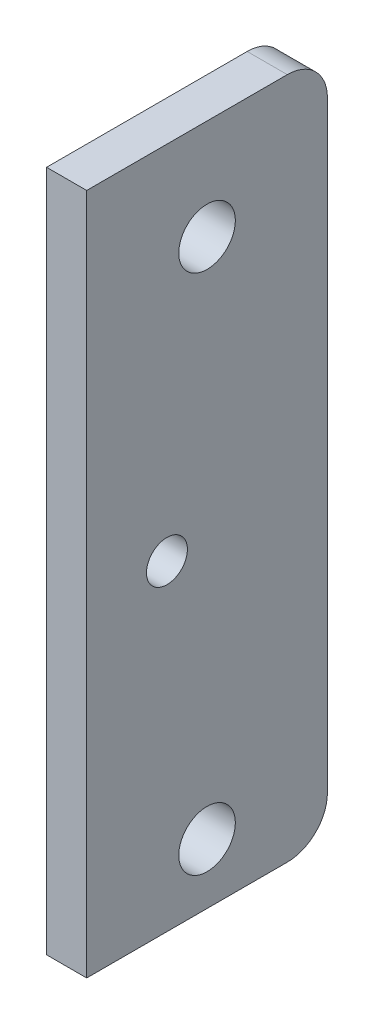
ISO-10303-21;
HEADER;
FILE_DESCRIPTION(('STEP AP214'),'2;1');
FILE_NAME('part.step','',(''),(''),'','','');
FILE_SCHEMA(('AUTOMOTIVE_DESIGN { 1 0 10303 214 1 1 1 1 }'));
ENDSEC;
DATA;
#1=APPLICATION_CONTEXT('core data for automotive mechanical design processes');
#2=APPLICATION_PROTOCOL_DEFINITION('international standard','automotive_design',2000,#1);
#3=PRODUCT_CONTEXT('',#1,'mechanical');
#4=PRODUCT('Part','Part','',(#3));
#5=PRODUCT_RELATED_PRODUCT_CATEGORY('part','',(#4));
#6=PRODUCT_DEFINITION_FORMATION('','',#4);
#7=PRODUCT_DEFINITION_CONTEXT('part definition',#1,'design');
#8=PRODUCT_DEFINITION('design','',#6,#7);
#9=PRODUCT_DEFINITION_SHAPE('','',#8);
#10=(LENGTH_UNIT() NAMED_UNIT(*) SI_UNIT(.MILLI.,.METRE.));
#11=(NAMED_UNIT(*) PLANE_ANGLE_UNIT() SI_UNIT($,.RADIAN.));
#12=(NAMED_UNIT(*) SI_UNIT($,.STERADIAN.) SOLID_ANGLE_UNIT());
#13=UNCERTAINTY_MEASURE_WITH_UNIT(LENGTH_MEASURE(1.E-05),#10,'distance_accuracy_value','');
#14=(GEOMETRIC_REPRESENTATION_CONTEXT(3) GLOBAL_UNCERTAINTY_ASSIGNED_CONTEXT((#13)) GLOBAL_UNIT_ASSIGNED_CONTEXT((#10,
#11,#12)) REPRESENTATION_CONTEXT('',''));
#15=CARTESIAN_POINT('',(0.,0.,0.));
#16=DIRECTION('',(0.,0.,1.));
#17=DIRECTION('',(1.,0.,0.));
#18=AXIS2_PLACEMENT_3D('',#15,#16,#17);
#19=CARTESIAN_POINT('',(-35.,0.,0.));
#20=DIRECTION('',(1.,0.,0.));
#21=DIRECTION('',(0.,0.,1.));
#22=AXIS2_PLACEMENT_3D('',#19,#20,#21);
#23=PLANE('',#22);
#24=CARTESIAN_POINT('',(-35.,-90.,-20.));
#25=DIRECTION('',(1.,0.,0.));
#26=DIRECTION('',(0.,0.,-1.));
#27=AXIS2_PLACEMENT_3D('',#24,#25,#26);
#28=CIRCLE('',#27,5.09999999999999);
#29=CARTESIAN_POINT('',(-35.,-90.,-25.1));
#30=VERTEX_POINT('',#29);
#31=EDGE_CURVE('E155',#30,#30,#28,.T.);
#32=ORIENTED_EDGE('',*,*,#31,.T.);
#33=EDGE_LOOP('',(#32));
#34=FACE_BOUND('',#33,.T.);
#35=DIRECTION('',(0.,0.,-1.));
#36=VECTOR('',#35,1.);
#37=CARTESIAN_POINT('',(-35.,-170.,0.));
#38=LINE('',#37,#36);
#39=CARTESIAN_POINT('',(-35.,-170.,0.));
#40=VERTEX_POINT('',#39);
#41=CARTESIAN_POINT('',(-35.,-170.,-50.));
#42=VERTEX_POINT('',#41);
#43=EDGE_CURVE('E109',#40,#42,#38,.T.);
#44=ORIENTED_EDGE('',*,*,#43,.F.);
#45=DIRECTION('',(0.,-1.,0.));
#46=VECTOR('',#45,1.);
#47=CARTESIAN_POINT('',(-35.,-170.,0.));
#48=LINE('',#47,#46);
#49=CARTESIAN_POINT('',(-35.,0.,0.));
#50=VERTEX_POINT('',#49);
#51=EDGE_CURVE('E92',#50,#40,#48,.T.);
#52=ORIENTED_EDGE('',*,*,#51,.F.);
#53=DIRECTION('',(0.,0.,1.));
#54=VECTOR('',#53,1.);
#55=CARTESIAN_POINT('',(-35.,0.,0.));
#56=LINE('',#55,#54);
#57=CARTESIAN_POINT('',(-35.,0.,-50.));
#58=VERTEX_POINT('',#57);
#59=EDGE_CURVE('E101',#58,#50,#56,.T.);
#60=ORIENTED_EDGE('',*,*,#59,.F.);
#61=CARTESIAN_POINT('',(-35.,-10.,-50.));
#62=DIRECTION('',(-1.,0.,0.));
#63=DIRECTION('',(0.,0.,1.));
#64=AXIS2_PLACEMENT_3D('',#61,#62,#63);
#65=CIRCLE('',#64,10.);
#66=CARTESIAN_POINT('',(-35.,-10.,-60.));
#67=VERTEX_POINT('',#66);
#68=EDGE_CURVE('E134',#67,#58,#65,.F.);
#69=ORIENTED_EDGE('',*,*,#68,.F.);
#70=DIRECTION('',(0.,1.,0.));
#71=VECTOR('',#70,1.);
#72=CARTESIAN_POINT('',(-35.,-170.,-60.));
#73=LINE('',#72,#71);
#74=CARTESIAN_POINT('',(-35.,-160.,-60.));
#75=VERTEX_POINT('',#74);
#76=EDGE_CURVE('E105',#75,#67,#73,.T.);
#77=ORIENTED_EDGE('',*,*,#76,.F.);
#78=CARTESIAN_POINT('',(-35.,-160.,-50.));
#79=DIRECTION('',(-1.,0.,0.));
#80=DIRECTION('',(0.,0.,1.));
#81=AXIS2_PLACEMENT_3D('',#78,#79,#80);
#82=CIRCLE('',#81,10.);
#83=EDGE_CURVE('E44',#42,#75,#82,.F.);
#84=ORIENTED_EDGE('',*,*,#83,.F.);
#85=EDGE_LOOP('',(#44,#52,#60,#69,#77,#84));
#86=FACE_BOUND('',#85,.T.);
#87=CARTESIAN_POINT('',(-35.,-25.,-30.));
#88=DIRECTION('',(1.,0.,0.));
#89=DIRECTION('',(0.,0.,-1.));
#90=AXIS2_PLACEMENT_3D('',#87,#88,#89);
#91=CIRCLE('',#90,7.05);
#92=CARTESIAN_POINT('',(-35.,-25.,-37.05));
#93=VERTEX_POINT('',#92);
#94=EDGE_CURVE('E118',#93,#93,#91,.T.);
#95=ORIENTED_EDGE('',*,*,#94,.T.);
#96=EDGE_LOOP('',(#95));
#97=FACE_BOUND('',#96,.T.);
#98=CARTESIAN_POINT('',(-35.,-155.,-30.));
#99=DIRECTION('',(1.,0.,0.));
#100=DIRECTION('',(0.,0.,-1.));
#101=AXIS2_PLACEMENT_3D('',#98,#99,#100);
#102=CIRCLE('',#101,7.05);
#103=CARTESIAN_POINT('',(-35.,-155.,-37.05));
#104=VERTEX_POINT('',#103);
#105=EDGE_CURVE('E144',#104,#104,#102,.T.);
#106=ORIENTED_EDGE('',*,*,#105,.T.);
#107=EDGE_LOOP('',(#106));
#108=FACE_BOUND('',#107,.T.);
#109=ADVANCED_FACE('F36',(#34,#86,#97,#108),#23,.F.);
#110=CARTESIAN_POINT('',(-25.,0.,0.));
#111=DIRECTION('',(1.,0.,0.));
#112=DIRECTION('',(0.,0.,1.));
#113=AXIS2_PLACEMENT_3D('',#110,#111,#112);
#114=PLANE('',#113);
#115=CARTESIAN_POINT('',(-25.,-90.,-20.));
#116=DIRECTION('',(-1.,0.,0.));
#117=DIRECTION('',(0.,0.,1.));
#118=AXIS2_PLACEMENT_3D('',#115,#116,#117);
#119=CIRCLE('',#118,5.09999999999999);
#120=CARTESIAN_POINT('',(-25.,-90.,-14.9));
#121=VERTEX_POINT('',#120);
#122=EDGE_CURVE('E150',#121,#121,#119,.T.);
#123=ORIENTED_EDGE('',*,*,#122,.T.);
#124=EDGE_LOOP('',(#123));
#125=FACE_BOUND('',#124,.T.);
#126=CARTESIAN_POINT('',(-25.,-25.,-30.));
#127=DIRECTION('',(1.,0.,0.));
#128=DIRECTION('',(0.,0.,-1.));
#129=AXIS2_PLACEMENT_3D('',#126,#127,#128);
#130=CIRCLE('',#129,7.05);
#131=CARTESIAN_POINT('',(-25.,-25.,-37.05));
#132=VERTEX_POINT('',#131);
#133=EDGE_CURVE('E141',#132,#132,#130,.T.);
#134=ORIENTED_EDGE('',*,*,#133,.F.);
#135=EDGE_LOOP('',(#134));
#136=FACE_BOUND('',#135,.T.);
#137=DIRECTION('',(0.,1.,0.));
#138=VECTOR('',#137,1.);
#139=CARTESIAN_POINT('',(-25.,-170.,-60.));
#140=LINE('',#139,#138);
#141=CARTESIAN_POINT('',(-25.,-160.,-60.));
#142=VERTEX_POINT('',#141);
#143=CARTESIAN_POINT('',(-25.,-10.,-60.));
#144=VERTEX_POINT('',#143);
#145=EDGE_CURVE('E114',#142,#144,#140,.T.);
#146=ORIENTED_EDGE('',*,*,#145,.T.);
#147=CARTESIAN_POINT('',(-25.,-10.,-50.));
#148=DIRECTION('',(-1.,0.,0.));
#149=DIRECTION('',(0.,0.,1.));
#150=AXIS2_PLACEMENT_3D('',#147,#148,#149);
#151=CIRCLE('',#150,10.);
#152=CARTESIAN_POINT('',(-25.,0.,-50.));
#153=VERTEX_POINT('',#152);
#154=EDGE_CURVE('E128',#153,#144,#151,.T.);
#155=ORIENTED_EDGE('',*,*,#154,.F.);
#156=DIRECTION('',(0.,0.,1.));
#157=VECTOR('',#156,1.);
#158=CARTESIAN_POINT('',(-25.,0.,0.));
#159=LINE('',#158,#157);
#160=CARTESIAN_POINT('',(-25.,0.,0.));
#161=VERTEX_POINT('',#160);
#162=EDGE_CURVE('E117',#153,#161,#159,.T.);
#163=ORIENTED_EDGE('',*,*,#162,.T.);
#164=DIRECTION('',(0.,-1.,0.));
#165=VECTOR('',#164,1.);
#166=CARTESIAN_POINT('',(-25.,-170.,0.));
#167=LINE('',#166,#165);
#168=CARTESIAN_POINT('',(-25.,-170.,0.));
#169=VERTEX_POINT('',#168);
#170=EDGE_CURVE('E95',#161,#169,#167,.T.);
#171=ORIENTED_EDGE('',*,*,#170,.T.);
#172=DIRECTION('',(0.,0.,-1.));
#173=VECTOR('',#172,1.);
#174=CARTESIAN_POINT('',(-25.,-170.,0.));
#175=LINE('',#174,#173);
#176=CARTESIAN_POINT('',(-25.,-170.,-50.));
#177=VERTEX_POINT('',#176);
#178=EDGE_CURVE('E121',#169,#177,#175,.T.);
#179=ORIENTED_EDGE('',*,*,#178,.T.);
#180=CARTESIAN_POINT('',(-25.,-160.,-50.));
#181=DIRECTION('',(-1.,0.,0.));
#182=DIRECTION('',(0.,0.,1.));
#183=AXIS2_PLACEMENT_3D('',#180,#181,#182);
#184=CIRCLE('',#183,10.);
#185=EDGE_CURVE('E131',#142,#177,#184,.T.);
#186=ORIENTED_EDGE('',*,*,#185,.F.);
#187=EDGE_LOOP('',(#146,#155,#163,#171,#179,#186));
#188=FACE_BOUND('',#187,.T.);
#189=CARTESIAN_POINT('',(-25.,-155.,-30.));
#190=DIRECTION('',(1.,0.,0.));
#191=DIRECTION('',(0.,0.,-1.));
#192=AXIS2_PLACEMENT_3D('',#189,#190,#191);
#193=CIRCLE('',#192,7.05);
#194=CARTESIAN_POINT('',(-25.,-155.,-37.05));
#195=VERTEX_POINT('',#194);
#196=EDGE_CURVE('E147',#195,#195,#193,.T.);
#197=ORIENTED_EDGE('',*,*,#196,.F.);
#198=EDGE_LOOP('',(#197));
#199=FACE_BOUND('',#198,.T.);
#200=ADVANCED_FACE('F166',(#125,#136,#188,#199),#114,.T.);
#201=CARTESIAN_POINT('',(-35.,-170.,-60.));
#202=DIRECTION('',(0.,0.,1.));
#203=DIRECTION('',(-1.,0.,0.));
#204=AXIS2_PLACEMENT_3D('',#201,#202,#203);
#205=PLANE('',#204);
#206=ORIENTED_EDGE('',*,*,#76,.T.);
#207=DIRECTION('',(1.,0.,0.));
#208=VECTOR('',#207,1.);
#209=CARTESIAN_POINT('',(-35.,-10.,-60.));
#210=LINE('',#209,#208);
#211=EDGE_CURVE('E97',#144,#67,#210,.F.);
#212=ORIENTED_EDGE('',*,*,#211,.F.);
#213=ORIENTED_EDGE('',*,*,#145,.F.);
#214=DIRECTION('',(1.,0.,0.));
#215=VECTOR('',#214,1.);
#216=CARTESIAN_POINT('',(-35.,-160.,-60.));
#217=LINE('',#216,#215);
#218=EDGE_CURVE('E126',#75,#142,#217,.T.);
#219=ORIENTED_EDGE('',*,*,#218,.F.);
#220=EDGE_LOOP('',(#206,#212,#213,#219));
#221=FACE_BOUND('',#220,.T.);
#222=ADVANCED_FACE('F169',(#221),#205,.F.);
#223=CARTESIAN_POINT('',(-35.,0.,0.));
#224=DIRECTION('',(0.,-1.,0.));
#225=DIRECTION('',(0.,0.,-1.));
#226=AXIS2_PLACEMENT_3D('',#223,#224,#225);
#227=PLANE('',#226);
#228=ORIENTED_EDGE('',*,*,#59,.T.);
#229=DIRECTION('',(1.,0.,0.));
#230=VECTOR('',#229,1.);
#231=CARTESIAN_POINT('',(-35.,0.,0.));
#232=LINE('',#231,#230);
#233=EDGE_CURVE('E89',#50,#161,#232,.T.);
#234=ORIENTED_EDGE('',*,*,#233,.T.);
#235=ORIENTED_EDGE('',*,*,#162,.F.);
#236=DIRECTION('',(1.,0.,0.));
#237=VECTOR('',#236,1.);
#238=CARTESIAN_POINT('',(-35.,0.,-50.));
#239=LINE('',#238,#237);
#240=EDGE_CURVE('E11',#58,#153,#239,.T.);
#241=ORIENTED_EDGE('',*,*,#240,.F.);
#242=EDGE_LOOP('',(#228,#234,#235,#241));
#243=FACE_BOUND('',#242,.T.);
#244=ADVANCED_FACE('F102',(#243),#227,.F.);
#245=CARTESIAN_POINT('',(-35.,-170.,0.));
#246=DIRECTION('',(0.,0.,-1.));
#247=DIRECTION('',(1.,0.,0.));
#248=AXIS2_PLACEMENT_3D('',#245,#246,#247);
#249=PLANE('',#248);
#250=ORIENTED_EDGE('',*,*,#170,.F.);
#251=ORIENTED_EDGE('',*,*,#233,.F.);
#252=ORIENTED_EDGE('',*,*,#51,.T.);
#253=DIRECTION('',(1.,0.,0.));
#254=VECTOR('',#253,1.);
#255=CARTESIAN_POINT('',(-35.,-170.,0.));
#256=LINE('',#255,#254);
#257=EDGE_CURVE('E98',#40,#169,#256,.T.);
#258=ORIENTED_EDGE('',*,*,#257,.T.);
#259=EDGE_LOOP('',(#250,#251,#252,#258));
#260=FACE_BOUND('',#259,.T.);
#261=ADVANCED_FACE('F90',(#260),#249,.F.);
#262=CARTESIAN_POINT('',(-35.,-170.,0.));
#263=DIRECTION('',(0.,1.,0.));
#264=DIRECTION('',(0.,0.,1.));
#265=AXIS2_PLACEMENT_3D('',#262,#263,#264);
#266=PLANE('',#265);
#267=ORIENTED_EDGE('',*,*,#178,.F.);
#268=ORIENTED_EDGE('',*,*,#257,.F.);
#269=ORIENTED_EDGE('',*,*,#43,.T.);
#270=DIRECTION('',(1.,0.,0.));
#271=VECTOR('',#270,1.);
#272=CARTESIAN_POINT('',(-35.,-170.,-50.));
#273=LINE('',#272,#271);
#274=EDGE_CURVE('E57',#177,#42,#273,.F.);
#275=ORIENTED_EDGE('',*,*,#274,.F.);
#276=EDGE_LOOP('',(#267,#268,#269,#275));
#277=FACE_BOUND('',#276,.T.);
#278=ADVANCED_FACE('F187',(#277),#266,.F.);
#279=CARTESIAN_POINT('',(-35.,-25.,-30.));
#280=DIRECTION('',(1.,0.,0.));
#281=DIRECTION('',(0.,0.,1.));
#282=AXIS2_PLACEMENT_3D('',#279,#280,#281);
#283=CYLINDRICAL_SURFACE('',#282,7.05);
#284=ORIENTED_EDGE('',*,*,#94,.F.);
#285=EDGE_LOOP('',(#284));
#286=FACE_BOUND('',#285,.T.);
#287=ORIENTED_EDGE('',*,*,#133,.T.);
#288=EDGE_LOOP('',(#287));
#289=FACE_BOUND('',#288,.T.);
#290=ADVANCED_FACE('F180',(#286,#289),#283,.F.);
#291=CARTESIAN_POINT('',(-35.,-155.,-30.));
#292=DIRECTION('',(1.,0.,0.));
#293=DIRECTION('',(0.,0.,1.));
#294=AXIS2_PLACEMENT_3D('',#291,#292,#293);
#295=CYLINDRICAL_SURFACE('',#294,7.05);
#296=ORIENTED_EDGE('',*,*,#105,.F.);
#297=EDGE_LOOP('',(#296));
#298=FACE_BOUND('',#297,.T.);
#299=ORIENTED_EDGE('',*,*,#196,.T.);
#300=EDGE_LOOP('',(#299));
#301=FACE_BOUND('',#300,.T.);
#302=ADVANCED_FACE('F178',(#298,#301),#295,.F.);
#303=CARTESIAN_POINT('',(-35.,-160.,-50.));
#304=DIRECTION('',(1.,0.,0.));
#305=DIRECTION('',(0.,0.,1.));
#306=AXIS2_PLACEMENT_3D('',#303,#304,#305);
#307=CYLINDRICAL_SURFACE('',#306,10.);
#308=ORIENTED_EDGE('',*,*,#83,.T.);
#309=ORIENTED_EDGE('',*,*,#218,.T.);
#310=ORIENTED_EDGE('',*,*,#185,.T.);
#311=ORIENTED_EDGE('',*,*,#274,.T.);
#312=EDGE_LOOP('',(#308,#309,#310,#311));
#313=FACE_BOUND('',#312,.T.);
#314=ADVANCED_FACE('F136',(#313),#307,.T.);
#315=CARTESIAN_POINT('',(-35.,-10.,-50.));
#316=DIRECTION('',(1.,0.,0.));
#317=DIRECTION('',(0.,0.,1.));
#318=AXIS2_PLACEMENT_3D('',#315,#316,#317);
#319=CYLINDRICAL_SURFACE('',#318,10.);
#320=ORIENTED_EDGE('',*,*,#68,.T.);
#321=ORIENTED_EDGE('',*,*,#240,.T.);
#322=ORIENTED_EDGE('',*,*,#154,.T.);
#323=ORIENTED_EDGE('',*,*,#211,.T.);
#324=EDGE_LOOP('',(#320,#321,#322,#323));
#325=FACE_BOUND('',#324,.T.);
#326=ADVANCED_FACE('F38',(#325),#319,.T.);
#327=CARTESIAN_POINT('',(-35.,-90.,-20.));
#328=DIRECTION('',(-1.,0.,0.));
#329=DIRECTION('',(0.,0.,-1.));
#330=AXIS2_PLACEMENT_3D('',#327,#328,#329);
#331=CYLINDRICAL_SURFACE('',#330,5.09999999999999);
#332=ORIENTED_EDGE('',*,*,#31,.F.);
#333=EDGE_LOOP('',(#332));
#334=FACE_BOUND('',#333,.T.);
#335=ORIENTED_EDGE('',*,*,#122,.F.);
#336=EDGE_LOOP('',(#335));
#337=FACE_BOUND('',#336,.T.);
#338=ADVANCED_FACE('F160',(#334,#337),#331,.F.);
#339=CLOSED_SHELL('',(#109,#200,#222,#244,#261,#278,#290,#302,#314,#326,#338));
#340=MANIFOLD_SOLID_BREP('B2',#339);
#341=ADVANCED_BREP_SHAPE_REPRESENTATION('',(#18,#340),#14);
#342=SHAPE_DEFINITION_REPRESENTATION(#9,#341);
ENDSEC;
END-ISO-10303-21;
